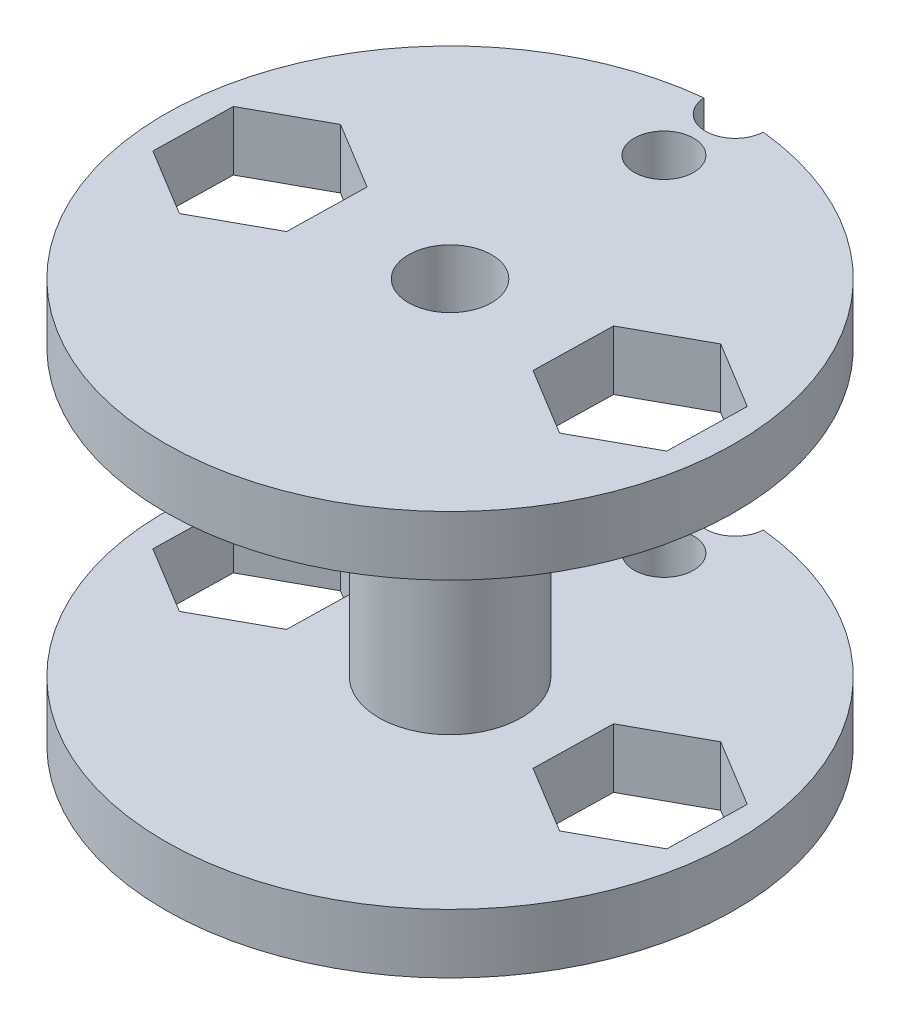
ISO-10303-21;
HEADER;
FILE_DESCRIPTION(('STEP AP214'),'2;1');
FILE_NAME('part.step','',(''),(''),'','','');
FILE_SCHEMA(('AUTOMOTIVE_DESIGN { 1 0 10303 214 1 1 1 1 }'));
ENDSEC;
DATA;
#1=APPLICATION_CONTEXT('core data for automotive mechanical design processes');
#2=APPLICATION_PROTOCOL_DEFINITION('international standard','automotive_design',2000,#1);
#3=PRODUCT_CONTEXT('',#1,'mechanical');
#4=PRODUCT('Part','Part','',(#3));
#5=PRODUCT_RELATED_PRODUCT_CATEGORY('part','',(#4));
#6=PRODUCT_DEFINITION_FORMATION('','',#4);
#7=PRODUCT_DEFINITION_CONTEXT('part definition',#1,'design');
#8=PRODUCT_DEFINITION('design','',#6,#7);
#9=PRODUCT_DEFINITION_SHAPE('','',#8);
#10=(LENGTH_UNIT() NAMED_UNIT(*) SI_UNIT(.MILLI.,.METRE.));
#11=(NAMED_UNIT(*) PLANE_ANGLE_UNIT() SI_UNIT($,.RADIAN.));
#12=(NAMED_UNIT(*) SI_UNIT($,.STERADIAN.) SOLID_ANGLE_UNIT());
#13=UNCERTAINTY_MEASURE_WITH_UNIT(LENGTH_MEASURE(1.E-05),#10,'distance_accuracy_value','');
#14=(GEOMETRIC_REPRESENTATION_CONTEXT(3) GLOBAL_UNCERTAINTY_ASSIGNED_CONTEXT((#13)) GLOBAL_UNIT_ASSIGNED_CONTEXT((#10,
#11,#12)) REPRESENTATION_CONTEXT('',''));
#15=CARTESIAN_POINT('',(0.,0.,0.));
#16=DIRECTION('',(0.,0.,1.));
#17=DIRECTION('',(1.,0.,0.));
#18=AXIS2_PLACEMENT_3D('',#15,#16,#17);
#19=CARTESIAN_POINT('',(0.,2.5,0.));
#20=DIRECTION('',(0.,1.,0.));
#21=DIRECTION('',(0.,0.,1.));
#22=AXIS2_PLACEMENT_3D('',#19,#20,#21);
#23=PLANE('',#22);
#24=DIRECTION('',(-0.0214869779830933,0.,0.999769128237692));
#25=VECTOR('',#24,1.);
#26=CARTESIAN_POINT('',(-5.08999790781407,2.5,-1.59772374233));
#27=LINE('',#26,#25);
#28=CARTESIAN_POINT('',(-5.08999790781407,2.5,-1.59772374233));
#29=VERTEX_POINT('',#28);
#30=CARTESIAN_POINT('',(-5.16132960481908,2.5,1.72127386573417));
#31=VERTEX_POINT('',#30);
#32=EDGE_CURVE('E484',#29,#31,#27,.T.);
#33=ORIENTED_EDGE('',*,*,#32,.T.);
#34=DIRECTION('',(-0.87656895196481,0.,0.48127629533493));
#35=VECTOR('',#34,1.);
#36=CARTESIAN_POINT('',(-5.16132960481908,2.5,1.72127386573417));
#37=LINE('',#36,#35);
#38=CARTESIAN_POINT('',(-8.07133169700495,2.5,3.31899760806487));
#39=VERTEX_POINT('',#38);
#40=EDGE_CURVE('E488',#31,#39,#37,.T.);
#41=ORIENTED_EDGE('',*,*,#40,.T.);
#42=DIRECTION('',(-0.855081973981716,0.,-0.518492832902762));
#43=VECTOR('',#42,1.);
#44=CARTESIAN_POINT('',(-8.07133169700495,2.5,3.31899760806487));
#45=LINE('',#44,#43);
#46=CARTESIAN_POINT('',(-10.9100020921858,2.5,1.59772374233139));
#47=VERTEX_POINT('',#46);
#48=EDGE_CURVE('E493',#39,#47,#45,.T.);
#49=ORIENTED_EDGE('',*,*,#48,.T.);
#50=DIRECTION('',(0.0214869779830943,0.,-0.999769128237692));
#51=VECTOR('',#50,1.);
#52=CARTESIAN_POINT('',(-10.9100020921858,2.5,1.59772374233139));
#53=LINE('',#52,#51);
#54=CARTESIAN_POINT('',(-10.8386703951808,2.5,-1.72127386573279));
#55=VERTEX_POINT('',#54);
#56=EDGE_CURVE('E497',#47,#55,#53,.T.);
#57=ORIENTED_EDGE('',*,*,#56,.T.);
#58=DIRECTION('',(0.87656895196481,0.,-0.48127629533493));
#59=VECTOR('',#58,1.);
#60=CARTESIAN_POINT('',(-10.8386703951808,2.5,-1.72127386573279));
#61=LINE('',#60,#59);
#62=CARTESIAN_POINT('',(-7.92866830299493,2.5,-3.31899760806348));
#63=VERTEX_POINT('',#62);
#64=EDGE_CURVE('E501',#55,#63,#61,.T.);
#65=ORIENTED_EDGE('',*,*,#64,.T.);
#66=DIRECTION('',(0.855081973981716,0.,0.518492832902762));
#67=VECTOR('',#66,1.);
#68=CARTESIAN_POINT('',(-7.92866830299493,2.5,-3.31899760806348));
#69=LINE('',#68,#67);
#70=EDGE_CURVE('E505',#63,#29,#69,.T.);
#71=ORIENTED_EDGE('',*,*,#70,.T.);
#72=EDGE_LOOP('',(#33,#41,#49,#57,#65,#71));
#73=FACE_BOUND('',#72,.T.);
#74=DIRECTION('',(0.0214869779832137,0.,-0.999769128237689));
#75=VECTOR('',#74,1.);
#76=CARTESIAN_POINT('',(5.089997907814,2.5,1.59772374233007));
#77=LINE('',#76,#75);
#78=CARTESIAN_POINT('',(5.089997907814,2.5,1.59772374233007));
#79=VERTEX_POINT('',#78);
#80=CARTESIAN_POINT('',(5.16132960481941,2.5,-1.72127386573409));
#81=VERTEX_POINT('',#80);
#82=EDGE_CURVE('E418',#79,#81,#77,.T.);
#83=ORIENTED_EDGE('',*,*,#82,.T.);
#84=DIRECTION('',(0.876568951964868,0.,-0.481276295334824));
#85=VECTOR('',#84,1.);
#86=CARTESIAN_POINT('',(5.16132960481941,2.5,-1.72127386573409));
#87=LINE('',#86,#85);
#88=CARTESIAN_POINT('',(8.07133169700547,2.5,-3.31899760806444));
#89=VERTEX_POINT('',#88);
#90=EDGE_CURVE('E422',#81,#89,#87,.T.);
#91=ORIENTED_EDGE('',*,*,#90,.T.);
#92=DIRECTION('',(0.855081973981654,0.,0.518492832902865));
#93=VECTOR('',#92,1.);
#94=CARTESIAN_POINT('',(8.07133169700547,2.5,-3.31899760806444));
#95=LINE('',#94,#93);
#96=CARTESIAN_POINT('',(10.9100020921861,2.5,-1.59772374233061));
#97=VERTEX_POINT('',#96);
#98=EDGE_CURVE('E64',#89,#97,#95,.T.);
#99=ORIENTED_EDGE('',*,*,#98,.T.);
#100=DIRECTION('',(-0.021486977983214,0.,0.999769128237689));
#101=VECTOR('',#100,1.);
#102=CARTESIAN_POINT('',(10.9100020921861,2.5,-1.59772374233061));
#103=LINE('',#102,#101);
#104=CARTESIAN_POINT('',(10.8386703951807,2.5,1.72127386573356));
#105=VERTEX_POINT('',#104);
#106=EDGE_CURVE('E429',#97,#105,#103,.T.);
#107=ORIENTED_EDGE('',*,*,#106,.T.);
#108=DIRECTION('',(-0.876568951964868,0.,0.481276295334824));
#109=VECTOR('',#108,1.);
#110=CARTESIAN_POINT('',(10.8386703951807,2.5,1.72127386573356));
#111=LINE('',#110,#109);
#112=CARTESIAN_POINT('',(7.92866830299465,2.5,3.3189976080639));
#113=VERTEX_POINT('',#112);
#114=EDGE_CURVE('E433',#105,#113,#111,.T.);
#115=ORIENTED_EDGE('',*,*,#114,.T.);
#116=DIRECTION('',(-0.855081973981654,0.,-0.518492832902865));
#117=VECTOR('',#116,1.);
#118=CARTESIAN_POINT('',(7.92866830299465,2.5,3.3189976080639));
#119=LINE('',#118,#117);
#120=EDGE_CURVE('E437',#113,#79,#119,.T.);
#121=ORIENTED_EDGE('',*,*,#120,.T.);
#122=EDGE_LOOP('',(#83,#91,#99,#107,#115,#121));
#123=FACE_BOUND('',#122,.T.);
#124=CARTESIAN_POINT('',(0.,2.5,-12.));
#125=DIRECTION('',(0.,1.,0.));
#126=DIRECTION('',(0.,0.,1.));
#127=AXIS2_PLACEMENT_3D('',#124,#125,#126);
#128=CIRCLE('',#127,1.25);
#129=CARTESIAN_POINT('',(-1.24830342764996,2.5,-11.9348958333333));
#130=VERTEX_POINT('',#129);
#131=CARTESIAN_POINT('',(1.24830342764996,2.5,-11.9348958333333));
#132=VERTEX_POINT('',#131);
#133=EDGE_CURVE('E409',#130,#132,#128,.T.);
#134=ORIENTED_EDGE('',*,*,#133,.F.);
#135=CARTESIAN_POINT('',(0.,2.5,0.));
#136=DIRECTION('',(0.,1.,0.));
#137=DIRECTION('',(0.,0.,1.));
#138=AXIS2_PLACEMENT_3D('',#135,#136,#137);
#139=CIRCLE('',#138,12.);
#140=EDGE_CURVE('E553',#130,#132,#139,.T.);
#141=ORIENTED_EDGE('',*,*,#140,.T.);
#142=EDGE_LOOP('',(#134,#141));
#143=FACE_BOUND('',#142,.T.);
#144=CARTESIAN_POINT('',(0.,2.5,-9.));
#145=DIRECTION('',(0.,1.,0.));
#146=DIRECTION('',(0.,0.,1.));
#147=AXIS2_PLACEMENT_3D('',#144,#145,#146);
#148=CIRCLE('',#147,1.25);
#149=CARTESIAN_POINT('',(0.,2.5,-7.75));
#150=VERTEX_POINT('',#149);
#151=EDGE_CURVE('E410',#150,#150,#148,.T.);
#152=ORIENTED_EDGE('',*,*,#151,.F.);
#153=EDGE_LOOP('',(#152));
#154=FACE_BOUND('',#153,.T.);
#155=CARTESIAN_POINT('',(0.,2.5,0.));
#156=DIRECTION('',(0.,1.,0.));
#157=DIRECTION('',(0.,0.,1.));
#158=AXIS2_PLACEMENT_3D('',#155,#156,#157);
#159=CIRCLE('',#158,3.);
#160=CARTESIAN_POINT('',(0.,2.5,3.));
#161=VERTEX_POINT('',#160);
#162=EDGE_CURVE('E237',#161,#161,#159,.T.);
#163=ORIENTED_EDGE('',*,*,#162,.F.);
#164=EDGE_LOOP('',(#163));
#165=FACE_BOUND('',#164,.T.);
#166=ADVANCED_FACE('F39',(#73,#123,#143,#154,#165),#23,.T.);
#167=CARTESIAN_POINT('',(0.,0.,0.));
#168=DIRECTION('',(0.,1.,0.));
#169=DIRECTION('',(0.,0.,1.));
#170=AXIS2_PLACEMENT_3D('',#167,#168,#169);
#171=PLANE('',#170);
#172=CARTESIAN_POINT('',(0.,0.,-9.));
#173=DIRECTION('',(0.,1.,0.));
#174=DIRECTION('',(0.,0.,1.));
#175=AXIS2_PLACEMENT_3D('',#172,#173,#174);
#176=CIRCLE('',#175,1.25);
#177=CARTESIAN_POINT('',(0.,0.,-7.75));
#178=VERTEX_POINT('',#177);
#179=EDGE_CURVE('E43',#178,#178,#176,.T.);
#180=ORIENTED_EDGE('',*,*,#179,.T.);
#181=EDGE_LOOP('',(#180));
#182=FACE_BOUND('',#181,.T.);
#183=DIRECTION('',(0.876568951964868,0.,-0.481276295334824));
#184=VECTOR('',#183,1.);
#185=CARTESIAN_POINT('',(5.16132960481941,0.,-1.72127386573409));
#186=LINE('',#185,#184);
#187=CARTESIAN_POINT('',(5.16132960481941,0.,-1.72127386573409));
#188=VERTEX_POINT('',#187);
#189=CARTESIAN_POINT('',(8.07133169700547,0.,-3.31899760806444));
#190=VERTEX_POINT('',#189);
#191=EDGE_CURVE('E445',#188,#190,#186,.T.);
#192=ORIENTED_EDGE('',*,*,#191,.F.);
#193=DIRECTION('',(0.0214869779832137,0.,-0.999769128237689));
#194=VECTOR('',#193,1.);
#195=CARTESIAN_POINT('',(5.089997907814,0.,1.59772374233007));
#196=LINE('',#195,#194);
#197=CARTESIAN_POINT('',(5.089997907814,0.,1.59772374233007));
#198=VERTEX_POINT('',#197);
#199=EDGE_CURVE('E442',#198,#188,#196,.T.);
#200=ORIENTED_EDGE('',*,*,#199,.F.);
#201=DIRECTION('',(-0.855081973981654,0.,-0.518492832902865));
#202=VECTOR('',#201,1.);
#203=CARTESIAN_POINT('',(7.92866830299465,0.,3.3189976080639));
#204=LINE('',#203,#202);
#205=CARTESIAN_POINT('',(7.92866830299465,0.,3.3189976080639));
#206=VERTEX_POINT('',#205);
#207=EDGE_CURVE('E423',#206,#198,#204,.T.);
#208=ORIENTED_EDGE('',*,*,#207,.F.);
#209=DIRECTION('',(-0.876568951964868,0.,0.481276295334824));
#210=VECTOR('',#209,1.);
#211=CARTESIAN_POINT('',(10.8386703951807,0.,1.72127386573356));
#212=LINE('',#211,#210);
#213=CARTESIAN_POINT('',(10.8386703951807,0.,1.72127386573356));
#214=VERTEX_POINT('',#213);
#215=EDGE_CURVE('E458',#214,#206,#212,.T.);
#216=ORIENTED_EDGE('',*,*,#215,.F.);
#217=DIRECTION('',(-0.021486977983214,0.,0.999769128237689));
#218=VECTOR('',#217,1.);
#219=CARTESIAN_POINT('',(10.9100020921861,0.,-1.59772374233061));
#220=LINE('',#219,#218);
#221=CARTESIAN_POINT('',(10.9100020921861,0.,-1.59772374233061));
#222=VERTEX_POINT('',#221);
#223=EDGE_CURVE('E454',#222,#214,#220,.T.);
#224=ORIENTED_EDGE('',*,*,#223,.F.);
#225=DIRECTION('',(0.855081973981654,0.,0.518492832902865));
#226=VECTOR('',#225,1.);
#227=CARTESIAN_POINT('',(8.07133169700547,0.,-3.31899760806444));
#228=LINE('',#227,#226);
#229=EDGE_CURVE('E450',#190,#222,#228,.T.);
#230=ORIENTED_EDGE('',*,*,#229,.F.);
#231=EDGE_LOOP('',(#192,#200,#208,#216,#224,#230));
#232=FACE_BOUND('',#231,.T.);
#233=DIRECTION('',(-0.87656895196481,0.,0.48127629533493));
#234=VECTOR('',#233,1.);
#235=CARTESIAN_POINT('',(-5.16132960481908,0.,1.72127386573417));
#236=LINE('',#235,#234);
#237=CARTESIAN_POINT('',(-5.16132960481908,0.,1.72127386573417));
#238=VERTEX_POINT('',#237);
#239=CARTESIAN_POINT('',(-8.07133169700495,0.,3.31899760806487));
#240=VERTEX_POINT('',#239);
#241=EDGE_CURVE('E513',#238,#240,#236,.T.);
#242=ORIENTED_EDGE('',*,*,#241,.F.);
#243=DIRECTION('',(-0.0214869779830933,0.,0.999769128237692));
#244=VECTOR('',#243,1.);
#245=CARTESIAN_POINT('',(-5.08999790781407,0.,-1.59772374233));
#246=LINE('',#245,#244);
#247=CARTESIAN_POINT('',(-5.08999790781407,0.,-1.59772374233));
#248=VERTEX_POINT('',#247);
#249=EDGE_CURVE('E510',#248,#238,#246,.T.);
#250=ORIENTED_EDGE('',*,*,#249,.F.);
#251=DIRECTION('',(0.855081973981716,0.,0.518492832902762));
#252=VECTOR('',#251,1.);
#253=CARTESIAN_POINT('',(-7.92866830299493,0.,-3.31899760806348));
#254=LINE('',#253,#252);
#255=CARTESIAN_POINT('',(-7.92866830299493,0.,-3.31899760806348));
#256=VERTEX_POINT('',#255);
#257=EDGE_CURVE('E489',#256,#248,#254,.T.);
#258=ORIENTED_EDGE('',*,*,#257,.F.);
#259=DIRECTION('',(0.87656895196481,0.,-0.48127629533493));
#260=VECTOR('',#259,1.);
#261=CARTESIAN_POINT('',(-10.8386703951808,0.,-1.72127386573279));
#262=LINE('',#261,#260);
#263=CARTESIAN_POINT('',(-10.8386703951808,0.,-1.72127386573279));
#264=VERTEX_POINT('',#263);
#265=EDGE_CURVE('E525',#264,#256,#262,.T.);
#266=ORIENTED_EDGE('',*,*,#265,.F.);
#267=DIRECTION('',(0.0214869779830943,0.,-0.999769128237692));
#268=VECTOR('',#267,1.);
#269=CARTESIAN_POINT('',(-10.9100020921858,0.,1.59772374233139));
#270=LINE('',#269,#268);
#271=CARTESIAN_POINT('',(-10.9100020921858,0.,1.59772374233139));
#272=VERTEX_POINT('',#271);
#273=EDGE_CURVE('E521',#272,#264,#270,.T.);
#274=ORIENTED_EDGE('',*,*,#273,.F.);
#275=DIRECTION('',(-0.855081973981716,0.,-0.518492832902762));
#276=VECTOR('',#275,1.);
#277=CARTESIAN_POINT('',(-8.07133169700495,0.,3.31899760806487));
#278=LINE('',#277,#276);
#279=EDGE_CURVE('E517',#240,#272,#278,.T.);
#280=ORIENTED_EDGE('',*,*,#279,.F.);
#281=EDGE_LOOP('',(#242,#250,#258,#266,#274,#280));
#282=FACE_BOUND('',#281,.T.);
#283=CARTESIAN_POINT('',(0.,0.,0.));
#284=DIRECTION('',(0.,1.,0.));
#285=DIRECTION('',(0.,0.,1.));
#286=AXIS2_PLACEMENT_3D('',#283,#284,#285);
#287=CIRCLE('',#286,12.);
#288=CARTESIAN_POINT('',(-1.24830342764996,0.,-11.9348958333333));
#289=VERTEX_POINT('',#288);
#290=CARTESIAN_POINT('',(1.24830342764998,0.,-11.9348958333333));
#291=VERTEX_POINT('',#290);
#292=EDGE_CURVE('E552',#289,#291,#287,.T.);
#293=ORIENTED_EDGE('',*,*,#292,.F.);
#294=CARTESIAN_POINT('',(0.,0.,-12.));
#295=DIRECTION('',(0.,1.,0.));
#296=DIRECTION('',(0.,0.,1.));
#297=AXIS2_PLACEMENT_3D('',#294,#295,#296);
#298=CIRCLE('',#297,1.25);
#299=EDGE_CURVE('E56',#289,#291,#298,.T.);
#300=ORIENTED_EDGE('',*,*,#299,.T.);
#301=EDGE_LOOP('',(#293,#300));
#302=FACE_BOUND('',#301,.T.);
#303=CARTESIAN_POINT('',(0.,0.,0.));
#304=DIRECTION('',(0.,1.,0.));
#305=DIRECTION('',(0.,0.,1.));
#306=AXIS2_PLACEMENT_3D('',#303,#304,#305);
#307=CIRCLE('',#306,1.75);
#308=CARTESIAN_POINT('',(0.,0.,1.75));
#309=VERTEX_POINT('',#308);
#310=EDGE_CURVE('E468',#309,#309,#307,.T.);
#311=ORIENTED_EDGE('',*,*,#310,.T.);
#312=EDGE_LOOP('',(#311));
#313=FACE_BOUND('',#312,.T.);
#314=ADVANCED_FACE('F566',(#182,#232,#282,#302,#313),#171,.F.);
#315=CARTESIAN_POINT('',(0.,2.5,0.));
#316=DIRECTION('',(0.,-1.,0.));
#317=DIRECTION('',(0.,0.,-1.));
#318=AXIS2_PLACEMENT_3D('',#315,#316,#317);
#319=CYLINDRICAL_SURFACE('',#318,12.);
#320=ORIENTED_EDGE('',*,*,#292,.T.);
#321=DIRECTION('',(0.,1.,0.));
#322=VECTOR('',#321,1.);
#323=CARTESIAN_POINT('',(1.24830342764996,0.,-11.9348958333333));
#324=LINE('',#323,#322);
#325=EDGE_CURVE('E11',#291,#132,#324,.T.);
#326=ORIENTED_EDGE('',*,*,#325,.T.);
#327=ORIENTED_EDGE('',*,*,#140,.F.);
#328=DIRECTION('',(0.,1.,0.));
#329=VECTOR('',#328,1.);
#330=CARTESIAN_POINT('',(-1.24830342764996,0.,-11.9348958333333));
#331=LINE('',#330,#329);
#332=EDGE_CURVE('E49',#130,#289,#331,.F.);
#333=ORIENTED_EDGE('',*,*,#332,.T.);
#334=EDGE_LOOP('',(#320,#326,#327,#333));
#335=FACE_BOUND('',#334,.T.);
#336=ADVANCED_FACE('F41',(#335),#319,.T.);
#337=CARTESIAN_POINT('',(0.,2.5,0.));
#338=DIRECTION('',(0.,-1.,0.));
#339=DIRECTION('',(0.,0.,-1.));
#340=AXIS2_PLACEMENT_3D('',#337,#338,#339);
#341=CYLINDRICAL_SURFACE('',#340,1.75);
#342=ORIENTED_EDGE('',*,*,#310,.F.);
#343=EDGE_LOOP('',(#342));
#344=FACE_BOUND('',#343,.T.);
#345=CARTESIAN_POINT('',(0.,17.,0.));
#346=DIRECTION('',(0.,1.,0.));
#347=DIRECTION('',(0.,0.,1.));
#348=AXIS2_PLACEMENT_3D('',#345,#346,#347);
#349=CIRCLE('',#348,1.75);
#350=CARTESIAN_POINT('',(0.,17.,1.75));
#351=VERTEX_POINT('',#350);
#352=EDGE_CURVE('E316',#351,#351,#349,.T.);
#353=ORIENTED_EDGE('',*,*,#352,.T.);
#354=EDGE_LOOP('',(#353));
#355=FACE_BOUND('',#354,.T.);
#356=ADVANCED_FACE('F572',(#344,#355),#341,.F.);
#357=CARTESIAN_POINT('',(-5.08999790781407,2.5,-1.59772374233));
#358=DIRECTION('',(0.999769128237692,0.,0.0214869779830933));
#359=DIRECTION('',(0.0214869779830933,0.,-0.999769128237692));
#360=AXIS2_PLACEMENT_3D('',#357,#358,#359);
#361=PLANE('',#360);
#362=ORIENTED_EDGE('',*,*,#249,.T.);
#363=DIRECTION('',(0.,-1.,0.));
#364=VECTOR('',#363,1.);
#365=CARTESIAN_POINT('',(-5.16132960481908,2.5,1.72127386573417));
#366=LINE('',#365,#364);
#367=EDGE_CURVE('E509',#31,#238,#366,.T.);
#368=ORIENTED_EDGE('',*,*,#367,.F.);
#369=ORIENTED_EDGE('',*,*,#32,.F.);
#370=DIRECTION('',(0.,-1.,0.));
#371=VECTOR('',#370,1.);
#372=CARTESIAN_POINT('',(-5.08999790781407,2.5,-1.59772374233));
#373=LINE('',#372,#371);
#374=EDGE_CURVE('E446',#29,#248,#373,.T.);
#375=ORIENTED_EDGE('',*,*,#374,.T.);
#376=EDGE_LOOP('',(#362,#368,#369,#375));
#377=FACE_BOUND('',#376,.T.);
#378=ADVANCED_FACE('F575',(#377),#361,.F.);
#379=CARTESIAN_POINT('',(-7.92866830299493,2.5,-3.31899760806348));
#380=DIRECTION('',(0.518492832902762,0.,-0.855081973981716));
#381=DIRECTION('',(-0.855081973981716,0.,-0.518492832902762));
#382=AXIS2_PLACEMENT_3D('',#379,#380,#381);
#383=PLANE('',#382);
#384=ORIENTED_EDGE('',*,*,#257,.T.);
#385=ORIENTED_EDGE('',*,*,#374,.F.);
#386=ORIENTED_EDGE('',*,*,#70,.F.);
#387=DIRECTION('',(0.,-1.,0.));
#388=VECTOR('',#387,1.);
#389=CARTESIAN_POINT('',(-7.92866830299493,2.5,-3.31899760806348));
#390=LINE('',#389,#388);
#391=EDGE_CURVE('E534',#63,#256,#390,.T.);
#392=ORIENTED_EDGE('',*,*,#391,.T.);
#393=EDGE_LOOP('',(#384,#385,#386,#392));
#394=FACE_BOUND('',#393,.T.);
#395=ADVANCED_FACE('F603',(#394),#383,.F.);
#396=CARTESIAN_POINT('',(-10.8386703951808,2.5,-1.72127386573279));
#397=DIRECTION('',(-0.48127629533493,0.,-0.87656895196481));
#398=DIRECTION('',(-0.87656895196481,0.,0.48127629533493));
#399=AXIS2_PLACEMENT_3D('',#396,#397,#398);
#400=PLANE('',#399);
#401=ORIENTED_EDGE('',*,*,#265,.T.);
#402=ORIENTED_EDGE('',*,*,#391,.F.);
#403=ORIENTED_EDGE('',*,*,#64,.F.);
#404=DIRECTION('',(0.,-1.,0.));
#405=VECTOR('',#404,1.);
#406=CARTESIAN_POINT('',(-10.8386703951808,2.5,-1.72127386573279));
#407=LINE('',#406,#405);
#408=EDGE_CURVE('E537',#55,#264,#407,.T.);
#409=ORIENTED_EDGE('',*,*,#408,.T.);
#410=EDGE_LOOP('',(#401,#402,#403,#409));
#411=FACE_BOUND('',#410,.T.);
#412=ADVANCED_FACE('F617',(#411),#400,.F.);
#413=CARTESIAN_POINT('',(-10.9100020921858,2.5,1.59772374233139));
#414=DIRECTION('',(-0.999769128237692,0.,-0.0214869779830943));
#415=DIRECTION('',(-0.0214869779830943,0.,0.999769128237692));
#416=AXIS2_PLACEMENT_3D('',#413,#414,#415);
#417=PLANE('',#416);
#418=ORIENTED_EDGE('',*,*,#273,.T.);
#419=ORIENTED_EDGE('',*,*,#408,.F.);
#420=ORIENTED_EDGE('',*,*,#56,.F.);
#421=DIRECTION('',(0.,-1.,0.));
#422=VECTOR('',#421,1.);
#423=CARTESIAN_POINT('',(-10.9100020921858,2.5,1.59772374233139));
#424=LINE('',#423,#422);
#425=EDGE_CURVE('E540',#47,#272,#424,.T.);
#426=ORIENTED_EDGE('',*,*,#425,.T.);
#427=EDGE_LOOP('',(#418,#419,#420,#426));
#428=FACE_BOUND('',#427,.T.);
#429=ADVANCED_FACE('F613',(#428),#417,.F.);
#430=CARTESIAN_POINT('',(-8.07133169700495,2.5,3.31899760806487));
#431=DIRECTION('',(-0.518492832902762,0.,0.855081973981716));
#432=DIRECTION('',(0.855081973981716,0.,0.518492832902762));
#433=AXIS2_PLACEMENT_3D('',#430,#431,#432);
#434=PLANE('',#433);
#435=ORIENTED_EDGE('',*,*,#279,.T.);
#436=ORIENTED_EDGE('',*,*,#425,.F.);
#437=ORIENTED_EDGE('',*,*,#48,.F.);
#438=DIRECTION('',(0.,-1.,0.));
#439=VECTOR('',#438,1.);
#440=CARTESIAN_POINT('',(-8.07133169700495,2.5,3.31899760806487));
#441=LINE('',#440,#439);
#442=EDGE_CURVE('E543',#39,#240,#441,.T.);
#443=ORIENTED_EDGE('',*,*,#442,.T.);
#444=EDGE_LOOP('',(#435,#436,#437,#443));
#445=FACE_BOUND('',#444,.T.);
#446=ADVANCED_FACE('F609',(#445),#434,.F.);
#447=CARTESIAN_POINT('',(-5.16132960481908,2.5,1.72127386573417));
#448=DIRECTION('',(0.48127629533493,0.,0.87656895196481));
#449=DIRECTION('',(0.87656895196481,0.,-0.48127629533493));
#450=AXIS2_PLACEMENT_3D('',#447,#448,#449);
#451=PLANE('',#450);
#452=ORIENTED_EDGE('',*,*,#241,.T.);
#453=ORIENTED_EDGE('',*,*,#442,.F.);
#454=ORIENTED_EDGE('',*,*,#40,.F.);
#455=ORIENTED_EDGE('',*,*,#367,.T.);
#456=EDGE_LOOP('',(#452,#453,#454,#455));
#457=FACE_BOUND('',#456,.T.);
#458=ADVANCED_FACE('F605',(#457),#451,.F.);
#459=CARTESIAN_POINT('',(5.089997907814,2.5,1.59772374233007));
#460=DIRECTION('',(-0.999769128237689,0.,-0.0214869779832137));
#461=DIRECTION('',(-0.0214869779832137,0.,0.999769128237689));
#462=AXIS2_PLACEMENT_3D('',#459,#460,#461);
#463=PLANE('',#462);
#464=ORIENTED_EDGE('',*,*,#199,.T.);
#465=DIRECTION('',(0.,-1.,0.));
#466=VECTOR('',#465,1.);
#467=CARTESIAN_POINT('',(5.16132960481941,2.5,-1.72127386573409));
#468=LINE('',#467,#466);
#469=EDGE_CURVE('E441',#81,#188,#468,.T.);
#470=ORIENTED_EDGE('',*,*,#469,.F.);
#471=ORIENTED_EDGE('',*,*,#82,.F.);
#472=DIRECTION('',(0.,-1.,0.));
#473=VECTOR('',#472,1.);
#474=CARTESIAN_POINT('',(5.089997907814,2.5,1.59772374233007));
#475=LINE('',#474,#473);
#476=EDGE_CURVE('E465',#79,#198,#475,.T.);
#477=ORIENTED_EDGE('',*,*,#476,.T.);
#478=EDGE_LOOP('',(#464,#470,#471,#477));
#479=FACE_BOUND('',#478,.T.);
#480=ADVANCED_FACE('F608',(#479),#463,.F.);
#481=CARTESIAN_POINT('',(7.92866830299465,2.5,3.3189976080639));
#482=DIRECTION('',(-0.518492832902865,0.,0.855081973981654));
#483=DIRECTION('',(0.855081973981654,0.,0.518492832902865));
#484=AXIS2_PLACEMENT_3D('',#481,#482,#483);
#485=PLANE('',#484);
#486=ORIENTED_EDGE('',*,*,#207,.T.);
#487=ORIENTED_EDGE('',*,*,#476,.F.);
#488=ORIENTED_EDGE('',*,*,#120,.F.);
#489=DIRECTION('',(0.,-1.,0.));
#490=VECTOR('',#489,1.);
#491=CARTESIAN_POINT('',(7.92866830299465,2.5,3.3189976080639));
#492=LINE('',#491,#490);
#493=EDGE_CURVE('E469',#113,#206,#492,.T.);
#494=ORIENTED_EDGE('',*,*,#493,.T.);
#495=EDGE_LOOP('',(#486,#487,#488,#494));
#496=FACE_BOUND('',#495,.T.);
#497=ADVANCED_FACE('F627',(#496),#485,.F.);
#498=CARTESIAN_POINT('',(10.8386703951807,2.5,1.72127386573356));
#499=DIRECTION('',(0.481276295334824,0.,0.876568951964868));
#500=DIRECTION('',(0.876568951964868,0.,-0.481276295334824));
#501=AXIS2_PLACEMENT_3D('',#498,#499,#500);
#502=PLANE('',#501);
#503=ORIENTED_EDGE('',*,*,#215,.T.);
#504=ORIENTED_EDGE('',*,*,#493,.F.);
#505=ORIENTED_EDGE('',*,*,#114,.F.);
#506=DIRECTION('',(0.,-1.,0.));
#507=VECTOR('',#506,1.);
#508=CARTESIAN_POINT('',(10.8386703951807,2.5,1.72127386573356));
#509=LINE('',#508,#507);
#510=EDGE_CURVE('E472',#105,#214,#509,.T.);
#511=ORIENTED_EDGE('',*,*,#510,.T.);
#512=EDGE_LOOP('',(#503,#504,#505,#511));
#513=FACE_BOUND('',#512,.T.);
#514=ADVANCED_FACE('F640',(#513),#502,.F.);
#515=CARTESIAN_POINT('',(10.9100020921861,2.5,-1.59772374233061));
#516=DIRECTION('',(0.999769128237689,0.,0.021486977983214));
#517=DIRECTION('',(0.021486977983214,0.,-0.999769128237689));
#518=AXIS2_PLACEMENT_3D('',#515,#516,#517);
#519=PLANE('',#518);
#520=ORIENTED_EDGE('',*,*,#223,.T.);
#521=ORIENTED_EDGE('',*,*,#510,.F.);
#522=ORIENTED_EDGE('',*,*,#106,.F.);
#523=DIRECTION('',(0.,-1.,0.));
#524=VECTOR('',#523,1.);
#525=CARTESIAN_POINT('',(10.9100020921861,2.5,-1.59772374233061));
#526=LINE('',#525,#524);
#527=EDGE_CURVE('E475',#97,#222,#526,.T.);
#528=ORIENTED_EDGE('',*,*,#527,.T.);
#529=EDGE_LOOP('',(#520,#521,#522,#528));
#530=FACE_BOUND('',#529,.T.);
#531=ADVANCED_FACE('F637',(#530),#519,.F.);
#532=CARTESIAN_POINT('',(8.07133169700547,2.5,-3.31899760806444));
#533=DIRECTION('',(0.518492832902865,0.,-0.855081973981654));
#534=DIRECTION('',(-0.855081973981654,0.,-0.518492832902865));
#535=AXIS2_PLACEMENT_3D('',#532,#533,#534);
#536=PLANE('',#535);
#537=ORIENTED_EDGE('',*,*,#229,.T.);
#538=ORIENTED_EDGE('',*,*,#527,.F.);
#539=ORIENTED_EDGE('',*,*,#98,.F.);
#540=DIRECTION('',(0.,-1.,0.));
#541=VECTOR('',#540,1.);
#542=CARTESIAN_POINT('',(8.07133169700547,2.5,-3.31899760806444));
#543=LINE('',#542,#541);
#544=EDGE_CURVE('E478',#89,#190,#543,.T.);
#545=ORIENTED_EDGE('',*,*,#544,.T.);
#546=EDGE_LOOP('',(#537,#538,#539,#545));
#547=FACE_BOUND('',#546,.T.);
#548=ADVANCED_FACE('F633',(#547),#536,.F.);
#549=CARTESIAN_POINT('',(5.16132960481941,2.5,-1.72127386573409));
#550=DIRECTION('',(-0.481276295334824,0.,-0.876568951964868));
#551=DIRECTION('',(-0.876568951964868,0.,0.481276295334825));
#552=AXIS2_PLACEMENT_3D('',#549,#550,#551);
#553=PLANE('',#552);
#554=ORIENTED_EDGE('',*,*,#191,.T.);
#555=ORIENTED_EDGE('',*,*,#544,.F.);
#556=ORIENTED_EDGE('',*,*,#90,.F.);
#557=ORIENTED_EDGE('',*,*,#469,.T.);
#558=EDGE_LOOP('',(#554,#555,#556,#557));
#559=FACE_BOUND('',#558,.T.);
#560=ADVANCED_FACE('F629',(#559),#553,.F.);
#561=CARTESIAN_POINT('',(0.,-2.5,-12.));
#562=DIRECTION('',(0.,1.,0.));
#563=DIRECTION('',(0.,0.,1.));
#564=AXIS2_PLACEMENT_3D('',#561,#562,#563);
#565=CYLINDRICAL_SURFACE('',#564,1.25);
#566=ORIENTED_EDGE('',*,*,#299,.F.);
#567=ORIENTED_EDGE('',*,*,#332,.F.);
#568=ORIENTED_EDGE('',*,*,#133,.T.);
#569=ORIENTED_EDGE('',*,*,#325,.F.);
#570=EDGE_LOOP('',(#566,#567,#568,#569));
#571=FACE_BOUND('',#570,.T.);
#572=ADVANCED_FACE('F632',(#571),#565,.F.);
#573=CARTESIAN_POINT('',(0.,-2.5,-9.));
#574=DIRECTION('',(0.,1.,0.));
#575=DIRECTION('',(0.,0.,1.));
#576=AXIS2_PLACEMENT_3D('',#573,#574,#575);
#577=CYLINDRICAL_SURFACE('',#576,1.25);
#578=ORIENTED_EDGE('',*,*,#151,.T.);
#579=EDGE_LOOP('',(#578));
#580=FACE_BOUND('',#579,.T.);
#581=ORIENTED_EDGE('',*,*,#179,.F.);
#582=EDGE_LOOP('',(#581));
#583=FACE_BOUND('',#582,.T.);
#584=ADVANCED_FACE('F650',(#580,#583),#577,.F.);
#585=CARTESIAN_POINT('',(0.,8.5,0.));
#586=DIRECTION('',(0.,-1.,0.));
#587=DIRECTION('',(0.,0.,-1.));
#588=AXIS2_PLACEMENT_3D('',#585,#586,#587);
#589=CYLINDRICAL_SURFACE('',#588,3.);
#590=ORIENTED_EDGE('',*,*,#162,.T.);
#591=EDGE_LOOP('',(#590));
#592=FACE_BOUND('',#591,.T.);
#593=CARTESIAN_POINT('',(0.,14.5,0.));
#594=DIRECTION('',(0.,1.,0.));
#595=DIRECTION('',(0.,0.,1.));
#596=AXIS2_PLACEMENT_3D('',#593,#594,#595);
#597=CIRCLE('',#596,3.);
#598=CARTESIAN_POINT('',(0.,14.5,3.));
#599=VERTEX_POINT('',#598);
#600=EDGE_CURVE('E251',#599,#599,#597,.T.);
#601=ORIENTED_EDGE('',*,*,#600,.F.);
#602=EDGE_LOOP('',(#601));
#603=FACE_BOUND('',#602,.T.);
#604=ADVANCED_FACE('F589',(#592,#603),#589,.T.);
#605=CARTESIAN_POINT('',(0.,14.5,0.));
#606=DIRECTION('',(0.,-1.,0.));
#607=DIRECTION('',(0.,0.,1.));
#608=AXIS2_PLACEMENT_3D('',#605,#606,#607);
#609=PLANE('',#608);
#610=DIRECTION('',(-0.0214869779830933,0.,0.999769128237692));
#611=VECTOR('',#610,1.);
#612=CARTESIAN_POINT('',(-5.08999790781407,14.5,-1.59772374233));
#613=LINE('',#612,#611);
#614=CARTESIAN_POINT('',(-5.08999790781407,14.5,-1.59772374233));
#615=VERTEX_POINT('',#614);
#616=CARTESIAN_POINT('',(-5.16132960481908,14.5,1.72127386573417));
#617=VERTEX_POINT('',#616);
#618=EDGE_CURVE('E331',#615,#617,#613,.T.);
#619=ORIENTED_EDGE('',*,*,#618,.F.);
#620=DIRECTION('',(0.855081973981716,0.,0.518492832902762));
#621=VECTOR('',#620,1.);
#622=CARTESIAN_POINT('',(-7.92866830299493,14.5,-3.31899760806348));
#623=LINE('',#622,#621);
#624=CARTESIAN_POINT('',(-7.92866830299493,14.5,-3.31899760806348));
#625=VERTEX_POINT('',#624);
#626=EDGE_CURVE('E352',#625,#615,#623,.T.);
#627=ORIENTED_EDGE('',*,*,#626,.F.);
#628=DIRECTION('',(0.87656895196481,0.,-0.48127629533493));
#629=VECTOR('',#628,1.);
#630=CARTESIAN_POINT('',(-10.8386703951808,14.5,-1.72127386573279));
#631=LINE('',#630,#629);
#632=CARTESIAN_POINT('',(-10.8386703951808,14.5,-1.72127386573279));
#633=VERTEX_POINT('',#632);
#634=EDGE_CURVE('E348',#633,#625,#631,.T.);
#635=ORIENTED_EDGE('',*,*,#634,.F.);
#636=DIRECTION('',(0.0214869779830943,0.,-0.999769128237692));
#637=VECTOR('',#636,1.);
#638=CARTESIAN_POINT('',(-10.9100020921858,14.5,1.59772374233139));
#639=LINE('',#638,#637);
#640=CARTESIAN_POINT('',(-10.9100020921858,14.5,1.59772374233139));
#641=VERTEX_POINT('',#640);
#642=EDGE_CURVE('E344',#641,#633,#639,.T.);
#643=ORIENTED_EDGE('',*,*,#642,.F.);
#644=DIRECTION('',(-0.855081973981716,0.,-0.518492832902762));
#645=VECTOR('',#644,1.);
#646=CARTESIAN_POINT('',(-8.07133169700495,14.5,3.31899760806487));
#647=LINE('',#646,#645);
#648=CARTESIAN_POINT('',(-8.07133169700495,14.5,3.31899760806487));
#649=VERTEX_POINT('',#648);
#650=EDGE_CURVE('E340',#649,#641,#647,.T.);
#651=ORIENTED_EDGE('',*,*,#650,.F.);
#652=DIRECTION('',(-0.87656895196481,0.,0.48127629533493));
#653=VECTOR('',#652,1.);
#654=CARTESIAN_POINT('',(-5.16132960481908,14.5,1.72127386573417));
#655=LINE('',#654,#653);
#656=EDGE_CURVE('E335',#617,#649,#655,.T.);
#657=ORIENTED_EDGE('',*,*,#656,.F.);
#658=EDGE_LOOP('',(#619,#627,#635,#643,#651,#657));
#659=FACE_BOUND('',#658,.T.);
#660=DIRECTION('',(0.0214869779832137,0.,-0.999769128237689));
#661=VECTOR('',#660,1.);
#662=CARTESIAN_POINT('',(5.089997907814,14.5,1.59772374233007));
#663=LINE('',#662,#661);
#664=CARTESIAN_POINT('',(5.089997907814,14.5,1.59772374233007));
#665=VERTEX_POINT('',#664);
#666=CARTESIAN_POINT('',(5.16132960481941,14.5,-1.72127386573409));
#667=VERTEX_POINT('',#666);
#668=EDGE_CURVE('E263',#665,#667,#663,.T.);
#669=ORIENTED_EDGE('',*,*,#668,.F.);
#670=DIRECTION('',(-0.855081973981654,0.,-0.518492832902865));
#671=VECTOR('',#670,1.);
#672=CARTESIAN_POINT('',(7.92866830299465,14.5,3.3189976080639));
#673=LINE('',#672,#671);
#674=CARTESIAN_POINT('',(7.92866830299465,14.5,3.3189976080639));
#675=VERTEX_POINT('',#674);
#676=EDGE_CURVE('E284',#675,#665,#673,.T.);
#677=ORIENTED_EDGE('',*,*,#676,.F.);
#678=DIRECTION('',(-0.876568951964868,0.,0.481276295334824));
#679=VECTOR('',#678,1.);
#680=CARTESIAN_POINT('',(10.8386703951807,14.5,1.72127386573356));
#681=LINE('',#680,#679);
#682=CARTESIAN_POINT('',(10.8386703951807,14.5,1.72127386573356));
#683=VERTEX_POINT('',#682);
#684=EDGE_CURVE('E280',#683,#675,#681,.T.);
#685=ORIENTED_EDGE('',*,*,#684,.F.);
#686=DIRECTION('',(-0.021486977983214,0.,0.999769128237689));
#687=VECTOR('',#686,1.);
#688=CARTESIAN_POINT('',(10.9100020921861,14.5,-1.59772374233061));
#689=LINE('',#688,#687);
#690=CARTESIAN_POINT('',(10.9100020921861,14.5,-1.59772374233061));
#691=VERTEX_POINT('',#690);
#692=EDGE_CURVE('E276',#691,#683,#689,.T.);
#693=ORIENTED_EDGE('',*,*,#692,.F.);
#694=DIRECTION('',(0.855081973981654,0.,0.518492832902865));
#695=VECTOR('',#694,1.);
#696=CARTESIAN_POINT('',(8.07133169700547,14.5,-3.31899760806444));
#697=LINE('',#696,#695);
#698=CARTESIAN_POINT('',(8.07133169700547,14.5,-3.31899760806444));
#699=VERTEX_POINT('',#698);
#700=EDGE_CURVE('E272',#699,#691,#697,.T.);
#701=ORIENTED_EDGE('',*,*,#700,.F.);
#702=DIRECTION('',(0.876568951964868,0.,-0.481276295334824));
#703=VECTOR('',#702,1.);
#704=CARTESIAN_POINT('',(5.16132960481941,14.5,-1.72127386573409));
#705=LINE('',#704,#703);
#706=EDGE_CURVE('E267',#667,#699,#705,.T.);
#707=ORIENTED_EDGE('',*,*,#706,.F.);
#708=EDGE_LOOP('',(#669,#677,#685,#693,#701,#707));
#709=FACE_BOUND('',#708,.T.);
#710=CARTESIAN_POINT('',(0.,14.5,-12.));
#711=DIRECTION('',(0.,1.,0.));
#712=DIRECTION('',(0.,0.,1.));
#713=AXIS2_PLACEMENT_3D('',#710,#711,#712);
#714=CIRCLE('',#713,1.25);
#715=CARTESIAN_POINT('',(-1.24830342764996,14.5,-11.9348958333333));
#716=VERTEX_POINT('',#715);
#717=CARTESIAN_POINT('',(1.24830342764996,14.5,-11.9348958333333));
#718=VERTEX_POINT('',#717);
#719=EDGE_CURVE('E230',#716,#718,#714,.T.);
#720=ORIENTED_EDGE('',*,*,#719,.T.);
#721=CARTESIAN_POINT('',(0.,14.5,0.));
#722=DIRECTION('',(0.,1.,0.));
#723=DIRECTION('',(0.,0.,1.));
#724=AXIS2_PLACEMENT_3D('',#721,#722,#723);
#725=CIRCLE('',#724,12.);
#726=EDGE_CURVE('E241',#716,#718,#725,.T.);
#727=ORIENTED_EDGE('',*,*,#726,.F.);
#728=EDGE_LOOP('',(#720,#727));
#729=FACE_BOUND('',#728,.T.);
#730=CARTESIAN_POINT('',(0.,14.5,-9.));
#731=DIRECTION('',(0.,1.,0.));
#732=DIRECTION('',(0.,0.,1.));
#733=AXIS2_PLACEMENT_3D('',#730,#731,#732);
#734=CIRCLE('',#733,1.25);
#735=CARTESIAN_POINT('',(0.,14.5,-7.75));
#736=VERTEX_POINT('',#735);
#737=EDGE_CURVE('E250',#736,#736,#734,.T.);
#738=ORIENTED_EDGE('',*,*,#737,.T.);
#739=EDGE_LOOP('',(#738));
#740=FACE_BOUND('',#739,.T.);
#741=ORIENTED_EDGE('',*,*,#600,.T.);
#742=EDGE_LOOP('',(#741));
#743=FACE_BOUND('',#742,.T.);
#744=ADVANCED_FACE('F247',(#659,#709,#729,#740,#743),#609,.T.);
#745=CARTESIAN_POINT('',(0.,17.,0.));
#746=DIRECTION('',(0.,-1.,0.));
#747=DIRECTION('',(0.,0.,1.));
#748=AXIS2_PLACEMENT_3D('',#745,#746,#747);
#749=PLANE('',#748);
#750=CARTESIAN_POINT('',(0.,17.,-9.));
#751=DIRECTION('',(0.,1.,0.));
#752=DIRECTION('',(0.,0.,1.));
#753=AXIS2_PLACEMENT_3D('',#750,#751,#752);
#754=CIRCLE('',#753,1.25);
#755=CARTESIAN_POINT('',(0.,17.,-7.75));
#756=VERTEX_POINT('',#755);
#757=EDGE_CURVE('E262',#756,#756,#754,.T.);
#758=ORIENTED_EDGE('',*,*,#757,.F.);
#759=EDGE_LOOP('',(#758));
#760=FACE_BOUND('',#759,.T.);
#761=DIRECTION('',(0.876568951964868,0.,-0.481276295334824));
#762=VECTOR('',#761,1.);
#763=CARTESIAN_POINT('',(5.16132960481941,17.,-1.72127386573409));
#764=LINE('',#763,#762);
#765=CARTESIAN_POINT('',(5.16132960481941,17.,-1.72127386573409));
#766=VERTEX_POINT('',#765);
#767=CARTESIAN_POINT('',(8.07133169700547,17.,-3.31899760806444));
#768=VERTEX_POINT('',#767);
#769=EDGE_CURVE('E293',#766,#768,#764,.T.);
#770=ORIENTED_EDGE('',*,*,#769,.T.);
#771=DIRECTION('',(0.855081973981654,0.,0.518492832902865));
#772=VECTOR('',#771,1.);
#773=CARTESIAN_POINT('',(8.07133169700547,17.,-3.31899760806444));
#774=LINE('',#773,#772);
#775=CARTESIAN_POINT('',(10.9100020921861,17.,-1.59772374233061));
#776=VERTEX_POINT('',#775);
#777=EDGE_CURVE('E298',#768,#776,#774,.T.);
#778=ORIENTED_EDGE('',*,*,#777,.T.);
#779=DIRECTION('',(-0.021486977983214,0.,0.999769128237689));
#780=VECTOR('',#779,1.);
#781=CARTESIAN_POINT('',(10.9100020921861,17.,-1.59772374233061));
#782=LINE('',#781,#780);
#783=CARTESIAN_POINT('',(10.8386703951807,17.,1.72127386573356));
#784=VERTEX_POINT('',#783);
#785=EDGE_CURVE('E302',#776,#784,#782,.T.);
#786=ORIENTED_EDGE('',*,*,#785,.T.);
#787=DIRECTION('',(-0.876568951964868,0.,0.481276295334824));
#788=VECTOR('',#787,1.);
#789=CARTESIAN_POINT('',(10.8386703951807,17.,1.72127386573356));
#790=LINE('',#789,#788);
#791=CARTESIAN_POINT('',(7.92866830299465,17.,3.3189976080639));
#792=VERTEX_POINT('',#791);
#793=EDGE_CURVE('E306',#784,#792,#790,.T.);
#794=ORIENTED_EDGE('',*,*,#793,.T.);
#795=DIRECTION('',(-0.855081973981654,0.,-0.518492832902865));
#796=VECTOR('',#795,1.);
#797=CARTESIAN_POINT('',(7.92866830299465,17.,3.3189976080639));
#798=LINE('',#797,#796);
#799=CARTESIAN_POINT('',(5.089997907814,17.,1.59772374233007));
#800=VERTEX_POINT('',#799);
#801=EDGE_CURVE('E268',#792,#800,#798,.T.);
#802=ORIENTED_EDGE('',*,*,#801,.T.);
#803=DIRECTION('',(0.0214869779832137,0.,-0.999769128237689));
#804=VECTOR('',#803,1.);
#805=CARTESIAN_POINT('',(5.089997907814,17.,1.59772374233007));
#806=LINE('',#805,#804);
#807=EDGE_CURVE('E289',#800,#766,#806,.T.);
#808=ORIENTED_EDGE('',*,*,#807,.T.);
#809=EDGE_LOOP('',(#770,#778,#786,#794,#802,#808));
#810=FACE_BOUND('',#809,.T.);
#811=DIRECTION('',(-0.87656895196481,0.,0.48127629533493));
#812=VECTOR('',#811,1.);
#813=CARTESIAN_POINT('',(-5.16132960481908,17.,1.72127386573417));
#814=LINE('',#813,#812);
#815=CARTESIAN_POINT('',(-5.16132960481908,17.,1.72127386573417));
#816=VERTEX_POINT('',#815);
#817=CARTESIAN_POINT('',(-8.07133169700495,17.,3.31899760806487));
#818=VERTEX_POINT('',#817);
#819=EDGE_CURVE('E361',#816,#818,#814,.T.);
#820=ORIENTED_EDGE('',*,*,#819,.T.);
#821=DIRECTION('',(-0.855081973981716,0.,-0.518492832902762));
#822=VECTOR('',#821,1.);
#823=CARTESIAN_POINT('',(-8.07133169700495,17.,3.31899760806487));
#824=LINE('',#823,#822);
#825=CARTESIAN_POINT('',(-10.9100020921858,17.,1.59772374233139));
#826=VERTEX_POINT('',#825);
#827=EDGE_CURVE('E365',#818,#826,#824,.T.);
#828=ORIENTED_EDGE('',*,*,#827,.T.);
#829=DIRECTION('',(0.0214869779830943,0.,-0.999769128237692));
#830=VECTOR('',#829,1.);
#831=CARTESIAN_POINT('',(-10.9100020921858,17.,1.59772374233139));
#832=LINE('',#831,#830);
#833=CARTESIAN_POINT('',(-10.8386703951808,17.,-1.72127386573279));
#834=VERTEX_POINT('',#833);
#835=EDGE_CURVE('E369',#826,#834,#832,.T.);
#836=ORIENTED_EDGE('',*,*,#835,.T.);
#837=DIRECTION('',(0.87656895196481,0.,-0.48127629533493));
#838=VECTOR('',#837,1.);
#839=CARTESIAN_POINT('',(-10.8386703951808,17.,-1.72127386573279));
#840=LINE('',#839,#838);
#841=CARTESIAN_POINT('',(-7.92866830299493,17.,-3.31899760806348));
#842=VERTEX_POINT('',#841);
#843=EDGE_CURVE('E373',#834,#842,#840,.T.);
#844=ORIENTED_EDGE('',*,*,#843,.T.);
#845=DIRECTION('',(0.855081973981716,0.,0.518492832902762));
#846=VECTOR('',#845,1.);
#847=CARTESIAN_POINT('',(-7.92866830299493,17.,-3.31899760806348));
#848=LINE('',#847,#846);
#849=CARTESIAN_POINT('',(-5.08999790781407,17.,-1.59772374233));
#850=VERTEX_POINT('',#849);
#851=EDGE_CURVE('E336',#842,#850,#848,.T.);
#852=ORIENTED_EDGE('',*,*,#851,.T.);
#853=DIRECTION('',(-0.0214869779830933,0.,0.999769128237692));
#854=VECTOR('',#853,1.);
#855=CARTESIAN_POINT('',(-5.08999790781407,17.,-1.59772374233));
#856=LINE('',#855,#854);
#857=EDGE_CURVE('E357',#850,#816,#856,.T.);
#858=ORIENTED_EDGE('',*,*,#857,.T.);
#859=EDGE_LOOP('',(#820,#828,#836,#844,#852,#858));
#860=FACE_BOUND('',#859,.T.);
#861=CARTESIAN_POINT('',(0.,17.,0.));
#862=DIRECTION('',(0.,1.,0.));
#863=DIRECTION('',(0.,0.,1.));
#864=AXIS2_PLACEMENT_3D('',#861,#862,#863);
#865=CIRCLE('',#864,12.);
#866=CARTESIAN_POINT('',(-1.24830342764996,17.,-11.9348958333333));
#867=VERTEX_POINT('',#866);
#868=CARTESIAN_POINT('',(1.24830342764998,17.,-11.9348958333333));
#869=VERTEX_POINT('',#868);
#870=EDGE_CURVE('E245',#867,#869,#865,.T.);
#871=ORIENTED_EDGE('',*,*,#870,.T.);
#872=CARTESIAN_POINT('',(0.,17.,-12.));
#873=DIRECTION('',(0.,1.,0.));
#874=DIRECTION('',(0.,0.,1.));
#875=AXIS2_PLACEMENT_3D('',#872,#873,#874);
#876=CIRCLE('',#875,1.25);
#877=EDGE_CURVE('E232',#867,#869,#876,.T.);
#878=ORIENTED_EDGE('',*,*,#877,.F.);
#879=EDGE_LOOP('',(#871,#878));
#880=FACE_BOUND('',#879,.T.);
#881=ORIENTED_EDGE('',*,*,#352,.F.);
#882=EDGE_LOOP('',(#881));
#883=FACE_BOUND('',#882,.T.);
#884=ADVANCED_FACE('F579',(#760,#810,#860,#880,#883),#749,.F.);
#885=CARTESIAN_POINT('',(0.,14.5,0.));
#886=DIRECTION('',(0.,1.,0.));
#887=DIRECTION('',(0.,0.,-1.));
#888=AXIS2_PLACEMENT_3D('',#885,#886,#887);
#889=CYLINDRICAL_SURFACE('',#888,12.);
#890=ORIENTED_EDGE('',*,*,#870,.F.);
#891=DIRECTION('',(0.,-1.,0.));
#892=VECTOR('',#891,1.);
#893=CARTESIAN_POINT('',(-1.24830342764996,17.,-11.9348958333333));
#894=LINE('',#893,#892);
#895=EDGE_CURVE('E238',#716,#867,#894,.F.);
#896=ORIENTED_EDGE('',*,*,#895,.F.);
#897=ORIENTED_EDGE('',*,*,#726,.T.);
#898=DIRECTION('',(0.,-1.,0.));
#899=VECTOR('',#898,1.);
#900=CARTESIAN_POINT('',(1.24830342764996,17.,-11.9348958333333));
#901=LINE('',#900,#899);
#902=EDGE_CURVE('E226',#869,#718,#901,.T.);
#903=ORIENTED_EDGE('',*,*,#902,.F.);
#904=EDGE_LOOP('',(#890,#896,#897,#903));
#905=FACE_BOUND('',#904,.T.);
#906=ADVANCED_FACE('F242',(#905),#889,.T.);
#907=CARTESIAN_POINT('',(-5.08999790781407,14.5,-1.59772374233));
#908=DIRECTION('',(0.999769128237692,0.,0.0214869779830933));
#909=DIRECTION('',(0.0214869779830933,0.,-0.999769128237692));
#910=AXIS2_PLACEMENT_3D('',#907,#908,#909);
#911=PLANE('',#910);
#912=ORIENTED_EDGE('',*,*,#857,.F.);
#913=DIRECTION('',(0.,1.,0.));
#914=VECTOR('',#913,1.);
#915=CARTESIAN_POINT('',(-5.08999790781407,14.5,-1.59772374233));
#916=LINE('',#915,#914);
#917=EDGE_CURVE('E294',#615,#850,#916,.T.);
#918=ORIENTED_EDGE('',*,*,#917,.F.);
#919=ORIENTED_EDGE('',*,*,#618,.T.);
#920=DIRECTION('',(0.,1.,0.));
#921=VECTOR('',#920,1.);
#922=CARTESIAN_POINT('',(-5.16132960481908,14.5,1.72127386573417));
#923=LINE('',#922,#921);
#924=EDGE_CURVE('E356',#617,#816,#923,.T.);
#925=ORIENTED_EDGE('',*,*,#924,.T.);
#926=EDGE_LOOP('',(#912,#918,#919,#925));
#927=FACE_BOUND('',#926,.T.);
#928=ADVANCED_FACE('F587',(#927),#911,.F.);
#929=CARTESIAN_POINT('',(-7.92866830299493,14.5,-3.31899760806348));
#930=DIRECTION('',(0.518492832902762,0.,-0.855081973981716));
#931=DIRECTION('',(-0.855081973981716,0.,-0.518492832902762));
#932=AXIS2_PLACEMENT_3D('',#929,#930,#931);
#933=PLANE('',#932);
#934=ORIENTED_EDGE('',*,*,#851,.F.);
#935=DIRECTION('',(0.,1.,0.));
#936=VECTOR('',#935,1.);
#937=CARTESIAN_POINT('',(-7.92866830299493,14.5,-3.31899760806348));
#938=LINE('',#937,#936);
#939=EDGE_CURVE('E382',#625,#842,#938,.T.);
#940=ORIENTED_EDGE('',*,*,#939,.F.);
#941=ORIENTED_EDGE('',*,*,#626,.T.);
#942=ORIENTED_EDGE('',*,*,#917,.T.);
#943=EDGE_LOOP('',(#934,#940,#941,#942));
#944=FACE_BOUND('',#943,.T.);
#945=ADVANCED_FACE('F689',(#944),#933,.F.);
#946=CARTESIAN_POINT('',(-10.8386703951808,14.5,-1.72127386573279));
#947=DIRECTION('',(-0.48127629533493,0.,-0.87656895196481));
#948=DIRECTION('',(-0.87656895196481,0.,0.48127629533493));
#949=AXIS2_PLACEMENT_3D('',#946,#947,#948);
#950=PLANE('',#949);
#951=ORIENTED_EDGE('',*,*,#843,.F.);
#952=DIRECTION('',(0.,1.,0.));
#953=VECTOR('',#952,1.);
#954=CARTESIAN_POINT('',(-10.8386703951808,14.5,-1.72127386573279));
#955=LINE('',#954,#953);
#956=EDGE_CURVE('E385',#633,#834,#955,.T.);
#957=ORIENTED_EDGE('',*,*,#956,.F.);
#958=ORIENTED_EDGE('',*,*,#634,.T.);
#959=ORIENTED_EDGE('',*,*,#939,.T.);
#960=EDGE_LOOP('',(#951,#957,#958,#959));
#961=FACE_BOUND('',#960,.T.);
#962=ADVANCED_FACE('F699',(#961),#950,.F.);
#963=CARTESIAN_POINT('',(-10.9100020921858,14.5,1.59772374233139));
#964=DIRECTION('',(-0.999769128237692,0.,-0.0214869779830943));
#965=DIRECTION('',(-0.0214869779830943,0.,0.999769128237692));
#966=AXIS2_PLACEMENT_3D('',#963,#964,#965);
#967=PLANE('',#966);
#968=ORIENTED_EDGE('',*,*,#835,.F.);
#969=DIRECTION('',(0.,1.,0.));
#970=VECTOR('',#969,1.);
#971=CARTESIAN_POINT('',(-10.9100020921858,14.5,1.59772374233139));
#972=LINE('',#971,#970);
#973=EDGE_CURVE('E388',#641,#826,#972,.T.);
#974=ORIENTED_EDGE('',*,*,#973,.F.);
#975=ORIENTED_EDGE('',*,*,#642,.T.);
#976=ORIENTED_EDGE('',*,*,#956,.T.);
#977=EDGE_LOOP('',(#968,#974,#975,#976));
#978=FACE_BOUND('',#977,.T.);
#979=ADVANCED_FACE('F709',(#978),#967,.F.);
#980=CARTESIAN_POINT('',(-8.07133169700495,14.5,3.31899760806487));
#981=DIRECTION('',(-0.518492832902762,0.,0.855081973981716));
#982=DIRECTION('',(0.855081973981716,0.,0.518492832902762));
#983=AXIS2_PLACEMENT_3D('',#980,#981,#982);
#984=PLANE('',#983);
#985=ORIENTED_EDGE('',*,*,#827,.F.);
#986=DIRECTION('',(0.,1.,0.));
#987=VECTOR('',#986,1.);
#988=CARTESIAN_POINT('',(-8.07133169700495,14.5,3.31899760806487));
#989=LINE('',#988,#987);
#990=EDGE_CURVE('E391',#649,#818,#989,.T.);
#991=ORIENTED_EDGE('',*,*,#990,.F.);
#992=ORIENTED_EDGE('',*,*,#650,.T.);
#993=ORIENTED_EDGE('',*,*,#973,.T.);
#994=EDGE_LOOP('',(#985,#991,#992,#993));
#995=FACE_BOUND('',#994,.T.);
#996=ADVANCED_FACE('F719',(#995),#984,.F.);
#997=CARTESIAN_POINT('',(-5.16132960481908,14.5,1.72127386573417));
#998=DIRECTION('',(0.48127629533493,0.,0.87656895196481));
#999=DIRECTION('',(0.87656895196481,0.,-0.48127629533493));
#1000=AXIS2_PLACEMENT_3D('',#997,#998,#999);
#1001=PLANE('',#1000);
#1002=ORIENTED_EDGE('',*,*,#819,.F.);
#1003=ORIENTED_EDGE('',*,*,#924,.F.);
#1004=ORIENTED_EDGE('',*,*,#656,.T.);
#1005=ORIENTED_EDGE('',*,*,#990,.T.);
#1006=EDGE_LOOP('',(#1002,#1003,#1004,#1005));
#1007=FACE_BOUND('',#1006,.T.);
#1008=ADVANCED_FACE('F729',(#1007),#1001,.F.);
#1009=CARTESIAN_POINT('',(5.089997907814,14.5,1.59772374233007));
#1010=DIRECTION('',(-0.999769128237689,0.,-0.0214869779832137));
#1011=DIRECTION('',(-0.0214869779832137,0.,0.999769128237689));
#1012=AXIS2_PLACEMENT_3D('',#1009,#1010,#1011);
#1013=PLANE('',#1012);
#1014=ORIENTED_EDGE('',*,*,#807,.F.);
#1015=DIRECTION('',(0.,1.,0.));
#1016=VECTOR('',#1015,1.);
#1017=CARTESIAN_POINT('',(5.089997907814,14.5,1.59772374233007));
#1018=LINE('',#1017,#1016);
#1019=EDGE_CURVE('E313',#665,#800,#1018,.T.);
#1020=ORIENTED_EDGE('',*,*,#1019,.F.);
#1021=ORIENTED_EDGE('',*,*,#668,.T.);
#1022=DIRECTION('',(0.,1.,0.));
#1023=VECTOR('',#1022,1.);
#1024=CARTESIAN_POINT('',(5.16132960481941,14.5,-1.72127386573409));
#1025=LINE('',#1024,#1023);
#1026=EDGE_CURVE('E288',#667,#766,#1025,.T.);
#1027=ORIENTED_EDGE('',*,*,#1026,.T.);
#1028=EDGE_LOOP('',(#1014,#1020,#1021,#1027));
#1029=FACE_BOUND('',#1028,.T.);
#1030=ADVANCED_FACE('F739',(#1029),#1013,.F.);
#1031=CARTESIAN_POINT('',(7.92866830299465,14.5,3.3189976080639));
#1032=DIRECTION('',(-0.518492832902865,0.,0.855081973981654));
#1033=DIRECTION('',(0.855081973981654,0.,0.518492832902865));
#1034=AXIS2_PLACEMENT_3D('',#1031,#1032,#1033);
#1035=PLANE('',#1034);
#1036=ORIENTED_EDGE('',*,*,#801,.F.);
#1037=DIRECTION('',(0.,1.,0.));
#1038=VECTOR('',#1037,1.);
#1039=CARTESIAN_POINT('',(7.92866830299465,14.5,3.3189976080639));
#1040=LINE('',#1039,#1038);
#1041=EDGE_CURVE('E317',#675,#792,#1040,.T.);
#1042=ORIENTED_EDGE('',*,*,#1041,.F.);
#1043=ORIENTED_EDGE('',*,*,#676,.T.);
#1044=ORIENTED_EDGE('',*,*,#1019,.T.);
#1045=EDGE_LOOP('',(#1036,#1042,#1043,#1044));
#1046=FACE_BOUND('',#1045,.T.);
#1047=ADVANCED_FACE('F749',(#1046),#1035,.F.);
#1048=CARTESIAN_POINT('',(10.8386703951807,14.5,1.72127386573356));
#1049=DIRECTION('',(0.481276295334824,0.,0.876568951964868));
#1050=DIRECTION('',(0.876568951964868,0.,-0.481276295334824));
#1051=AXIS2_PLACEMENT_3D('',#1048,#1049,#1050);
#1052=PLANE('',#1051);
#1053=ORIENTED_EDGE('',*,*,#793,.F.);
#1054=DIRECTION('',(0.,1.,0.));
#1055=VECTOR('',#1054,1.);
#1056=CARTESIAN_POINT('',(10.8386703951807,14.5,1.72127386573356));
#1057=LINE('',#1056,#1055);
#1058=EDGE_CURVE('E320',#683,#784,#1057,.T.);
#1059=ORIENTED_EDGE('',*,*,#1058,.F.);
#1060=ORIENTED_EDGE('',*,*,#684,.T.);
#1061=ORIENTED_EDGE('',*,*,#1041,.T.);
#1062=EDGE_LOOP('',(#1053,#1059,#1060,#1061));
#1063=FACE_BOUND('',#1062,.T.);
#1064=ADVANCED_FACE('F759',(#1063),#1052,.F.);
#1065=CARTESIAN_POINT('',(10.9100020921861,14.5,-1.59772374233061));
#1066=DIRECTION('',(0.999769128237689,0.,0.021486977983214));
#1067=DIRECTION('',(0.021486977983214,0.,-0.999769128237689));
#1068=AXIS2_PLACEMENT_3D('',#1065,#1066,#1067);
#1069=PLANE('',#1068);
#1070=ORIENTED_EDGE('',*,*,#785,.F.);
#1071=DIRECTION('',(0.,1.,0.));
#1072=VECTOR('',#1071,1.);
#1073=CARTESIAN_POINT('',(10.9100020921861,14.5,-1.59772374233061));
#1074=LINE('',#1073,#1072);
#1075=EDGE_CURVE('E323',#691,#776,#1074,.T.);
#1076=ORIENTED_EDGE('',*,*,#1075,.F.);
#1077=ORIENTED_EDGE('',*,*,#692,.T.);
#1078=ORIENTED_EDGE('',*,*,#1058,.T.);
#1079=EDGE_LOOP('',(#1070,#1076,#1077,#1078));
#1080=FACE_BOUND('',#1079,.T.);
#1081=ADVANCED_FACE('F769',(#1080),#1069,.F.);
#1082=CARTESIAN_POINT('',(8.07133169700547,14.5,-3.31899760806444));
#1083=DIRECTION('',(0.518492832902865,0.,-0.855081973981654));
#1084=DIRECTION('',(-0.855081973981654,0.,-0.518492832902865));
#1085=AXIS2_PLACEMENT_3D('',#1082,#1083,#1084);
#1086=PLANE('',#1085);
#1087=ORIENTED_EDGE('',*,*,#777,.F.);
#1088=DIRECTION('',(0.,1.,0.));
#1089=VECTOR('',#1088,1.);
#1090=CARTESIAN_POINT('',(8.07133169700547,14.5,-3.31899760806444));
#1091=LINE('',#1090,#1089);
#1092=EDGE_CURVE('E326',#699,#768,#1091,.T.);
#1093=ORIENTED_EDGE('',*,*,#1092,.F.);
#1094=ORIENTED_EDGE('',*,*,#700,.T.);
#1095=ORIENTED_EDGE('',*,*,#1075,.T.);
#1096=EDGE_LOOP('',(#1087,#1093,#1094,#1095));
#1097=FACE_BOUND('',#1096,.T.);
#1098=ADVANCED_FACE('F779',(#1097),#1086,.F.);
#1099=CARTESIAN_POINT('',(5.16132960481941,14.5,-1.72127386573409));
#1100=DIRECTION('',(-0.481276295334824,0.,-0.876568951964868));
#1101=DIRECTION('',(-0.876568951964868,0.,0.481276295334825));
#1102=AXIS2_PLACEMENT_3D('',#1099,#1100,#1101);
#1103=PLANE('',#1102);
#1104=ORIENTED_EDGE('',*,*,#769,.F.);
#1105=ORIENTED_EDGE('',*,*,#1026,.F.);
#1106=ORIENTED_EDGE('',*,*,#706,.T.);
#1107=ORIENTED_EDGE('',*,*,#1092,.T.);
#1108=EDGE_LOOP('',(#1104,#1105,#1106,#1107));
#1109=FACE_BOUND('',#1108,.T.);
#1110=ADVANCED_FACE('F789',(#1109),#1103,.F.);
#1111=CARTESIAN_POINT('',(0.,19.5,-12.));
#1112=DIRECTION('',(0.,-1.,0.));
#1113=DIRECTION('',(0.,0.,1.));
#1114=AXIS2_PLACEMENT_3D('',#1111,#1112,#1113);
#1115=CYLINDRICAL_SURFACE('',#1114,1.25);
#1116=ORIENTED_EDGE('',*,*,#877,.T.);
#1117=ORIENTED_EDGE('',*,*,#902,.T.);
#1118=ORIENTED_EDGE('',*,*,#719,.F.);
#1119=ORIENTED_EDGE('',*,*,#895,.T.);
#1120=EDGE_LOOP('',(#1116,#1117,#1118,#1119));
#1121=FACE_BOUND('',#1120,.T.);
#1122=ADVANCED_FACE('F228',(#1121),#1115,.F.);
#1123=CARTESIAN_POINT('',(0.,19.5,-9.));
#1124=DIRECTION('',(0.,-1.,0.));
#1125=DIRECTION('',(0.,0.,1.));
#1126=AXIS2_PLACEMENT_3D('',#1123,#1124,#1125);
#1127=CYLINDRICAL_SURFACE('',#1126,1.25);
#1128=ORIENTED_EDGE('',*,*,#737,.F.);
#1129=EDGE_LOOP('',(#1128));
#1130=FACE_BOUND('',#1129,.T.);
#1131=ORIENTED_EDGE('',*,*,#757,.T.);
#1132=EDGE_LOOP('',(#1131));
#1133=FACE_BOUND('',#1132,.T.);
#1134=ADVANCED_FACE('F808',(#1130,#1133),#1127,.F.);
#1135=CLOSED_SHELL('',(#166,#314,#336,#356,#378,#395,#412,#429,#446,#458,#480,#497,#514,#531,
#548,#560,#572,#584,#604,#744,#884,#906,#928,#945,#962,#979,#996,#1008,#1030,#1047,#1064,#1081,
#1098,#1110,#1122,#1134));
#1136=MANIFOLD_SOLID_BREP('B2',#1135);
#1137=ADVANCED_BREP_SHAPE_REPRESENTATION('',(#18,#1136),#14);
#1138=SHAPE_DEFINITION_REPRESENTATION(#9,#1137);
ENDSEC;
END-ISO-10303-21;
